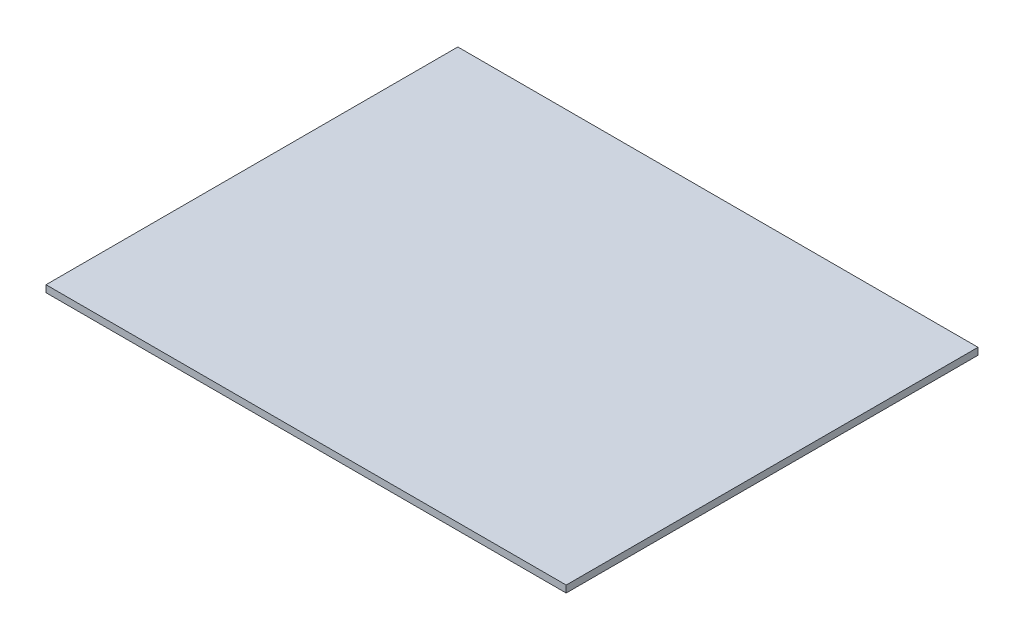
ISO-10303-21;
HEADER;
FILE_DESCRIPTION(('STEP AP214'),'2;1');
FILE_NAME('part.step','',(''),(''),'','','');
FILE_SCHEMA(('AUTOMOTIVE_DESIGN { 1 0 10303 214 1 1 1 1 }'));
ENDSEC;
DATA;
#1=APPLICATION_CONTEXT('core data for automotive mechanical design processes');
#2=APPLICATION_PROTOCOL_DEFINITION('international standard','automotive_design',2000,#1);
#3=PRODUCT_CONTEXT('',#1,'mechanical');
#4=PRODUCT('Part','Part','',(#3));
#5=PRODUCT_RELATED_PRODUCT_CATEGORY('part','',(#4));
#6=PRODUCT_DEFINITION_FORMATION('','',#4);
#7=PRODUCT_DEFINITION_CONTEXT('part definition',#1,'design');
#8=PRODUCT_DEFINITION('design','',#6,#7);
#9=PRODUCT_DEFINITION_SHAPE('','',#8);
#10=(LENGTH_UNIT() NAMED_UNIT(*) SI_UNIT(.MILLI.,.METRE.));
#11=(NAMED_UNIT(*) PLANE_ANGLE_UNIT() SI_UNIT($,.RADIAN.));
#12=(NAMED_UNIT(*) SI_UNIT($,.STERADIAN.) SOLID_ANGLE_UNIT());
#13=UNCERTAINTY_MEASURE_WITH_UNIT(LENGTH_MEASURE(1.E-05),#10,'distance_accuracy_value','');
#14=(GEOMETRIC_REPRESENTATION_CONTEXT(3) GLOBAL_UNCERTAINTY_ASSIGNED_CONTEXT((#13)) GLOBAL_UNIT_ASSIGNED_CONTEXT((#10,
#11,#12)) REPRESENTATION_CONTEXT('',''));
#15=CARTESIAN_POINT('',(0.,0.,0.));
#16=DIRECTION('',(0.,0.,1.));
#17=DIRECTION('',(1.,0.,0.));
#18=AXIS2_PLACEMENT_3D('',#15,#16,#17);
#19=CARTESIAN_POINT('',(0.,16.,-950.));
#20=DIRECTION('',(0.,0.,-1.));
#21=DIRECTION('',(-1.,0.,0.));
#22=AXIS2_PLACEMENT_3D('',#19,#20,#21);
#23=PLANE('',#22);
#24=DIRECTION('',(1.,0.,0.));
#25=VECTOR('',#24,1.);
#26=CARTESIAN_POINT('',(0.,0.,-950.));
#27=LINE('',#26,#25);
#28=CARTESIAN_POINT('',(0.,0.,-950.));
#29=VERTEX_POINT('',#28);
#30=CARTESIAN_POINT('',(1200.,0.,-950.));
#31=VERTEX_POINT('',#30);
#32=EDGE_CURVE('E99',#29,#31,#27,.T.);
#33=ORIENTED_EDGE('',*,*,#32,.F.);
#34=DIRECTION('',(0.,-1.,0.));
#35=VECTOR('',#34,1.);
#36=CARTESIAN_POINT('',(0.,16.,-950.));
#37=LINE('',#36,#35);
#38=CARTESIAN_POINT('',(0.,16.,-950.));
#39=VERTEX_POINT('',#38);
#40=EDGE_CURVE('E11',#39,#29,#37,.T.);
#41=ORIENTED_EDGE('',*,*,#40,.F.);
#42=DIRECTION('',(1.,0.,0.));
#43=VECTOR('',#42,1.);
#44=CARTESIAN_POINT('',(0.,16.,-950.));
#45=LINE('',#44,#43);
#46=CARTESIAN_POINT('',(1200.,16.,-950.));
#47=VERTEX_POINT('',#46);
#48=EDGE_CURVE('E93',#39,#47,#45,.T.);
#49=ORIENTED_EDGE('',*,*,#48,.T.);
#50=DIRECTION('',(0.,-1.,0.));
#51=VECTOR('',#50,1.);
#52=CARTESIAN_POINT('',(1200.,16.,-950.));
#53=LINE('',#52,#51);
#54=EDGE_CURVE('E38',#47,#31,#53,.T.);
#55=ORIENTED_EDGE('',*,*,#54,.T.);
#56=EDGE_LOOP('',(#33,#41,#49,#55));
#57=FACE_BOUND('',#56,.T.);
#58=ADVANCED_FACE('F35',(#57),#23,.T.);
#59=CARTESIAN_POINT('',(0.,16.,0.));
#60=DIRECTION('',(-1.,0.,0.));
#61=DIRECTION('',(0.,0.,1.));
#62=AXIS2_PLACEMENT_3D('',#59,#60,#61);
#63=PLANE('',#62);
#64=DIRECTION('',(0.,0.,-1.));
#65=VECTOR('',#64,1.);
#66=CARTESIAN_POINT('',(0.,0.,0.));
#67=LINE('',#66,#65);
#68=CARTESIAN_POINT('',(0.,0.,0.));
#69=VERTEX_POINT('',#68);
#70=EDGE_CURVE('E95',#69,#29,#67,.T.);
#71=ORIENTED_EDGE('',*,*,#70,.F.);
#72=DIRECTION('',(0.,-1.,0.));
#73=VECTOR('',#72,1.);
#74=CARTESIAN_POINT('',(0.,16.,0.));
#75=LINE('',#74,#73);
#76=CARTESIAN_POINT('',(0.,16.,0.));
#77=VERTEX_POINT('',#76);
#78=EDGE_CURVE('E44',#77,#69,#75,.T.);
#79=ORIENTED_EDGE('',*,*,#78,.F.);
#80=DIRECTION('',(0.,0.,-1.));
#81=VECTOR('',#80,1.);
#82=CARTESIAN_POINT('',(0.,16.,0.));
#83=LINE('',#82,#81);
#84=EDGE_CURVE('E83',#77,#39,#83,.T.);
#85=ORIENTED_EDGE('',*,*,#84,.T.);
#86=ORIENTED_EDGE('',*,*,#40,.T.);
#87=EDGE_LOOP('',(#71,#79,#85,#86));
#88=FACE_BOUND('',#87,.T.);
#89=ADVANCED_FACE('F109',(#88),#63,.T.);
#90=CARTESIAN_POINT('',(0.,16.,0.));
#91=DIRECTION('',(0.,0.,-1.));
#92=DIRECTION('',(-1.,0.,0.));
#93=AXIS2_PLACEMENT_3D('',#90,#91,#92);
#94=PLANE('',#93);
#95=DIRECTION('',(1.,0.,0.));
#96=VECTOR('',#95,1.);
#97=CARTESIAN_POINT('',(0.,0.,0.));
#98=LINE('',#97,#96);
#99=CARTESIAN_POINT('',(1200.,0.,0.));
#100=VERTEX_POINT('',#99);
#101=EDGE_CURVE('E88',#69,#100,#98,.T.);
#102=ORIENTED_EDGE('',*,*,#101,.T.);
#103=DIRECTION('',(0.,-1.,0.));
#104=VECTOR('',#103,1.);
#105=CARTESIAN_POINT('',(1200.,16.,0.));
#106=LINE('',#105,#104);
#107=CARTESIAN_POINT('',(1200.,16.,0.));
#108=VERTEX_POINT('',#107);
#109=EDGE_CURVE('E86',#108,#100,#106,.T.);
#110=ORIENTED_EDGE('',*,*,#109,.F.);
#111=DIRECTION('',(1.,0.,0.));
#112=VECTOR('',#111,1.);
#113=CARTESIAN_POINT('',(0.,16.,0.));
#114=LINE('',#113,#112);
#115=EDGE_CURVE('E80',#77,#108,#114,.T.);
#116=ORIENTED_EDGE('',*,*,#115,.F.);
#117=ORIENTED_EDGE('',*,*,#78,.T.);
#118=EDGE_LOOP('',(#102,#110,#116,#117));
#119=FACE_BOUND('',#118,.T.);
#120=ADVANCED_FACE('F87',(#119),#94,.F.);
#121=CARTESIAN_POINT('',(1200.,16.,0.));
#122=DIRECTION('',(-1.,0.,0.));
#123=DIRECTION('',(0.,0.,1.));
#124=AXIS2_PLACEMENT_3D('',#121,#122,#123);
#125=PLANE('',#124);
#126=DIRECTION('',(0.,0.,-1.));
#127=VECTOR('',#126,1.);
#128=CARTESIAN_POINT('',(1200.,0.,0.));
#129=LINE('',#128,#127);
#130=EDGE_CURVE('E102',#100,#31,#129,.T.);
#131=ORIENTED_EDGE('',*,*,#130,.T.);
#132=ORIENTED_EDGE('',*,*,#54,.F.);
#133=DIRECTION('',(0.,0.,-1.));
#134=VECTOR('',#133,1.);
#135=CARTESIAN_POINT('',(1200.,16.,0.));
#136=LINE('',#135,#134);
#137=EDGE_CURVE('E77',#108,#47,#136,.T.);
#138=ORIENTED_EDGE('',*,*,#137,.F.);
#139=ORIENTED_EDGE('',*,*,#109,.T.);
#140=EDGE_LOOP('',(#131,#132,#138,#139));
#141=FACE_BOUND('',#140,.T.);
#142=ADVANCED_FACE('F92',(#141),#125,.F.);
#143=CARTESIAN_POINT('',(0.,16.,0.));
#144=DIRECTION('',(0.,1.,0.));
#145=DIRECTION('',(0.,0.,1.));
#146=AXIS2_PLACEMENT_3D('',#143,#144,#145);
#147=PLANE('',#146);
#148=ORIENTED_EDGE('',*,*,#48,.F.);
#149=ORIENTED_EDGE('',*,*,#84,.F.);
#150=ORIENTED_EDGE('',*,*,#115,.T.);
#151=ORIENTED_EDGE('',*,*,#137,.T.);
#152=EDGE_LOOP('',(#148,#149,#150,#151));
#153=FACE_BOUND('',#152,.T.);
#154=ADVANCED_FACE('F82',(#153),#147,.T.);
#155=CARTESIAN_POINT('',(0.,0.,0.));
#156=DIRECTION('',(0.,1.,0.));
#157=DIRECTION('',(0.,0.,1.));
#158=AXIS2_PLACEMENT_3D('',#155,#156,#157);
#159=PLANE('',#158);
#160=ORIENTED_EDGE('',*,*,#32,.T.);
#161=ORIENTED_EDGE('',*,*,#130,.F.);
#162=ORIENTED_EDGE('',*,*,#101,.F.);
#163=ORIENTED_EDGE('',*,*,#70,.T.);
#164=EDGE_LOOP('',(#160,#161,#162,#163));
#165=FACE_BOUND('',#164,.T.);
#166=ADVANCED_FACE('F108',(#165),#159,.F.);
#167=CLOSED_SHELL('',(#58,#89,#120,#142,#154,#166));
#168=MANIFOLD_SOLID_BREP('B2',#167);
#169=ADVANCED_BREP_SHAPE_REPRESENTATION('',(#18,#168),#14);
#170=SHAPE_DEFINITION_REPRESENTATION(#9,#169);
ENDSEC;
END-ISO-10303-21;
